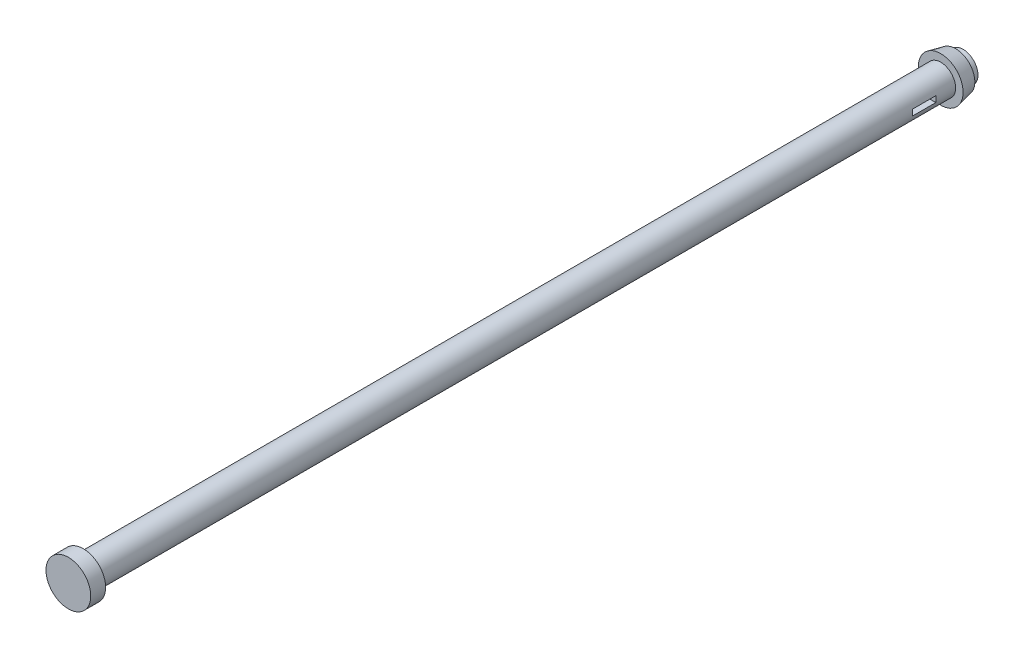
ISO-10303-21;
HEADER;
FILE_DESCRIPTION(('STEP AP214'),'2;1');
FILE_NAME('part.step','',(''),(''),'','','');
FILE_SCHEMA(('AUTOMOTIVE_DESIGN { 1 0 10303 214 1 1 1 1 }'));
ENDSEC;
DATA;
#1=APPLICATION_CONTEXT('core data for automotive mechanical design processes');
#2=APPLICATION_PROTOCOL_DEFINITION('international standard','automotive_design',2000,#1);
#3=PRODUCT_CONTEXT('',#1,'mechanical');
#4=PRODUCT('Part','Part','',(#3));
#5=PRODUCT_RELATED_PRODUCT_CATEGORY('part','',(#4));
#6=PRODUCT_DEFINITION_FORMATION('','',#4);
#7=PRODUCT_DEFINITION_CONTEXT('part definition',#1,'design');
#8=PRODUCT_DEFINITION('design','',#6,#7);
#9=PRODUCT_DEFINITION_SHAPE('','',#8);
#10=(LENGTH_UNIT() NAMED_UNIT(*) SI_UNIT(.MILLI.,.METRE.));
#11=(NAMED_UNIT(*) PLANE_ANGLE_UNIT() SI_UNIT($,.RADIAN.));
#12=(NAMED_UNIT(*) SI_UNIT($,.STERADIAN.) SOLID_ANGLE_UNIT());
#13=UNCERTAINTY_MEASURE_WITH_UNIT(LENGTH_MEASURE(1.E-05),#10,'distance_accuracy_value','');
#14=(GEOMETRIC_REPRESENTATION_CONTEXT(3) GLOBAL_UNCERTAINTY_ASSIGNED_CONTEXT((#13)) GLOBAL_UNIT_ASSIGNED_CONTEXT((#10,
#11,#12)) REPRESENTATION_CONTEXT('',''));
#15=CARTESIAN_POINT('',(0.,0.,0.));
#16=DIRECTION('',(0.,0.,1.));
#17=DIRECTION('',(1.,0.,0.));
#18=AXIS2_PLACEMENT_3D('',#15,#16,#17);
#19=CARTESIAN_POINT('',(0.,-2.05997398991745E-12,590.));
#20=DIRECTION('',(0.,0.,-1.));
#21=DIRECTION('',(0.,1.,0.));
#22=AXIS2_PLACEMENT_3D('',#19,#20,#21);
#23=CYLINDRICAL_SURFACE('',#22,10.);
#24=DIRECTION('',(0.,0.,-1.));
#25=VECTOR('',#24,1.);
#26=CARTESIAN_POINT('',(9.79795897113229,2.,590.));
#27=LINE('',#26,#25);
#28=CARTESIAN_POINT('',(9.79795897113229,2.,28.0848451641344));
#29=VERTEX_POINT('',#28);
#30=CARTESIAN_POINT('',(9.79795897113229,2.,43.8685984767884));
#31=VERTEX_POINT('',#30);
#32=EDGE_CURVE('E90',#29,#31,#27,.F.);
#33=ORIENTED_EDGE('',*,*,#32,.F.);
#34=CARTESIAN_POINT('',(0.,0.,28.0848451641345));
#35=DIRECTION('',(0.,0.,1.));
#36=DIRECTION('',(1.,0.,0.));
#37=AXIS2_PLACEMENT_3D('',#34,#35,#36);
#38=CIRCLE('',#37,10.);
#39=CARTESIAN_POINT('',(9.79795897113313,-2.,28.0848451641344));
#40=VERTEX_POINT('',#39);
#41=EDGE_CURVE('E76',#40,#29,#38,.T.);
#42=ORIENTED_EDGE('',*,*,#41,.F.);
#43=DIRECTION('',(0.,0.,-1.));
#44=VECTOR('',#43,1.);
#45=CARTESIAN_POINT('',(9.79795897113313,-2.,590.));
#46=LINE('',#45,#44);
#47=CARTESIAN_POINT('',(9.79795897113313,-1.99999999999809,43.8685984767884));
#48=VERTEX_POINT('',#47);
#49=EDGE_CURVE('E72',#40,#48,#46,.F.);
#50=ORIENTED_EDGE('',*,*,#49,.T.);
#51=CARTESIAN_POINT('',(0.,-1.53166392942909E-13,43.8685984767884));
#52=DIRECTION('',(0.,0.,-1.));
#53=DIRECTION('',(-1.,0.,0.));
#54=AXIS2_PLACEMENT_3D('',#51,#52,#53);
#55=CIRCLE('',#54,10.);
#56=EDGE_CURVE('E91',#31,#48,#55,.T.);
#57=ORIENTED_EDGE('',*,*,#56,.F.);
#58=EDGE_LOOP('',(#33,#42,#50,#57));
#59=FACE_BOUND('',#58,.T.);
#60=CARTESIAN_POINT('',(0.,-2.05997398991745E-12,590.));
#61=DIRECTION('',(0.,0.,1.));
#62=DIRECTION('',(0.,-1.,0.));
#63=AXIS2_PLACEMENT_3D('',#60,#61,#62);
#64=CIRCLE('',#63,10.);
#65=CARTESIAN_POINT('',(0.,-10.0000000000021,590.));
#66=VERTEX_POINT('',#65);
#67=EDGE_CURVE('E124',#66,#66,#64,.T.);
#68=ORIENTED_EDGE('',*,*,#67,.F.);
#69=EDGE_LOOP('',(#68));
#70=FACE_BOUND('',#69,.T.);
#71=CARTESIAN_POINT('',(0.,0.,15.));
#72=DIRECTION('',(0.,0.,-1.));
#73=DIRECTION('',(0.,1.,0.));
#74=AXIS2_PLACEMENT_3D('',#71,#72,#73);
#75=CIRCLE('',#74,10.);
#76=CARTESIAN_POINT('',(0.,9.99999999999995,15.));
#77=VERTEX_POINT('',#76);
#78=EDGE_CURVE('E77',#77,#77,#75,.T.);
#79=ORIENTED_EDGE('',*,*,#78,.F.);
#80=EDGE_LOOP('',(#79));
#81=FACE_BOUND('',#80,.T.);
#82=DIRECTION('',(0.,0.,-1.));
#83=VECTOR('',#82,1.);
#84=CARTESIAN_POINT('',(-9.79795897113229,2.,590.));
#85=LINE('',#84,#83);
#86=CARTESIAN_POINT('',(-9.79795897113229,2.,43.8685984767884));
#87=VERTEX_POINT('',#86);
#88=CARTESIAN_POINT('',(-9.79795897113229,2.,28.0848451641344));
#89=VERTEX_POINT('',#88);
#90=EDGE_CURVE('E11',#87,#89,#85,.T.);
#91=ORIENTED_EDGE('',*,*,#90,.F.);
#92=CARTESIAN_POINT('',(-9.79795897113313,-2.,43.8685984767884));
#93=VERTEX_POINT('',#92);
#94=EDGE_CURVE('E42',#93,#87,#55,.T.);
#95=ORIENTED_EDGE('',*,*,#94,.F.);
#96=DIRECTION('',(0.,0.,-1.));
#97=VECTOR('',#96,1.);
#98=CARTESIAN_POINT('',(-9.79795897113313,-2.,590.));
#99=LINE('',#98,#97);
#100=CARTESIAN_POINT('',(-9.79795897113313,-1.99999999999804,28.0848451641345));
#101=VERTEX_POINT('',#100);
#102=EDGE_CURVE('E94',#93,#101,#99,.T.);
#103=ORIENTED_EDGE('',*,*,#102,.T.);
#104=EDGE_CURVE('E83',#89,#101,#38,.T.);
#105=ORIENTED_EDGE('',*,*,#104,.F.);
#106=EDGE_LOOP('',(#91,#95,#103,#105));
#107=FACE_BOUND('',#106,.T.);
#108=ADVANCED_FACE('F34',(#59,#70,#81,#107),#23,.T.);
#109=CARTESIAN_POINT('',(0.,-2.09488880330588E-12,600.));
#110=DIRECTION('',(0.,0.,-1.));
#111=DIRECTION('',(0.,1.,0.));
#112=AXIS2_PLACEMENT_3D('',#109,#110,#111);
#113=CYLINDRICAL_SURFACE('',#112,15.);
#114=CARTESIAN_POINT('',(0.,-2.09488880330588E-12,600.));
#115=DIRECTION('',(0.,0.,1.));
#116=DIRECTION('',(0.,-1.,0.));
#117=AXIS2_PLACEMENT_3D('',#114,#115,#116);
#118=CIRCLE('',#117,15.);
#119=CARTESIAN_POINT('',(0.,-15.0000000000021,600.));
#120=VERTEX_POINT('',#119);
#121=EDGE_CURVE('E117',#120,#120,#118,.T.);
#122=ORIENTED_EDGE('',*,*,#121,.F.);
#123=EDGE_LOOP('',(#122));
#124=FACE_BOUND('',#123,.T.);
#125=CARTESIAN_POINT('',(0.,-2.05997398991745E-12,590.));
#126=DIRECTION('',(0.,0.,1.));
#127=DIRECTION('',(0.,-1.,0.));
#128=AXIS2_PLACEMENT_3D('',#125,#126,#127);
#129=CIRCLE('',#128,15.);
#130=CARTESIAN_POINT('',(0.,-15.0000000000021,590.));
#131=VERTEX_POINT('',#130);
#132=EDGE_CURVE('E121',#131,#131,#129,.T.);
#133=ORIENTED_EDGE('',*,*,#132,.T.);
#134=EDGE_LOOP('',(#133));
#135=FACE_BOUND('',#134,.T.);
#136=ADVANCED_FACE('F160',(#124,#135),#113,.T.);
#137=CARTESIAN_POINT('',(0.,-2.09488880330588E-12,600.));
#138=DIRECTION('',(0.,0.,1.));
#139=DIRECTION('',(0.,-1.,0.));
#140=AXIS2_PLACEMENT_3D('',#137,#138,#139);
#141=PLANE('',#140);
#142=ORIENTED_EDGE('',*,*,#121,.T.);
#143=EDGE_LOOP('',(#142));
#144=FACE_BOUND('',#143,.T.);
#145=ADVANCED_FACE('F165',(#144),#141,.T.);
#146=CARTESIAN_POINT('',(0.,-2.05997398991745E-12,590.));
#147=DIRECTION('',(0.,0.,1.));
#148=DIRECTION('',(0.,-1.,0.));
#149=AXIS2_PLACEMENT_3D('',#146,#147,#148);
#150=PLANE('',#149);
#151=ORIENTED_EDGE('',*,*,#67,.T.);
#152=EDGE_LOOP('',(#151));
#153=FACE_BOUND('',#152,.T.);
#154=ORIENTED_EDGE('',*,*,#132,.F.);
#155=EDGE_LOOP('',(#154));
#156=FACE_BOUND('',#155,.T.);
#157=ADVANCED_FACE('F146',(#153,#156),#150,.F.);
#158=CARTESIAN_POINT('',(0.,0.,15.));
#159=DIRECTION('',(0.,0.,1.));
#160=DIRECTION('',(0.,1.,0.));
#161=AXIS2_PLACEMENT_3D('',#158,#159,#160);
#162=CONICAL_SURFACE('',#161,15.,0.20943951023932);
#163=CARTESIAN_POINT('',(0.,0.,5.));
#164=DIRECTION('',(0.,0.,-1.));
#165=DIRECTION('',(0.,1.,0.));
#166=AXIS2_PLACEMENT_3D('',#163,#164,#165);
#167=CIRCLE('',#166,12.8744343832998);
#168=CARTESIAN_POINT('',(0.,12.8744343832998,5.00000000000004));
#169=VERTEX_POINT('',#168);
#170=EDGE_CURVE('E113',#169,#169,#167,.T.);
#171=ORIENTED_EDGE('',*,*,#170,.F.);
#172=EDGE_LOOP('',(#171));
#173=FACE_BOUND('',#172,.T.);
#174=CARTESIAN_POINT('',(0.,0.,15.));
#175=DIRECTION('',(0.,0.,-1.));
#176=DIRECTION('',(0.,1.,0.));
#177=AXIS2_PLACEMENT_3D('',#174,#175,#176);
#178=CIRCLE('',#177,15.);
#179=CARTESIAN_POINT('',(0.,14.9999999999999,15.0000000000001));
#180=VERTEX_POINT('',#179);
#181=EDGE_CURVE('E107',#180,#180,#178,.T.);
#182=ORIENTED_EDGE('',*,*,#181,.T.);
#183=EDGE_LOOP('',(#182));
#184=FACE_BOUND('',#183,.T.);
#185=ADVANCED_FACE('F140',(#173,#184),#162,.T.);
#186=CARTESIAN_POINT('',(0.,0.,5.));
#187=DIRECTION('',(0.,0.,-1.));
#188=DIRECTION('',(0.,1.,0.));
#189=AXIS2_PLACEMENT_3D('',#186,#187,#188);
#190=PLANE('',#189);
#191=CARTESIAN_POINT('',(0.,0.,5.));
#192=DIRECTION('',(0.,0.,-1.));
#193=DIRECTION('',(0.,1.,0.));
#194=AXIS2_PLACEMENT_3D('',#191,#192,#193);
#195=CIRCLE('',#194,10.);
#196=CARTESIAN_POINT('',(0.,9.99999999999998,5.00000000000004));
#197=VERTEX_POINT('',#196);
#198=EDGE_CURVE('E116',#197,#197,#195,.T.);
#199=ORIENTED_EDGE('',*,*,#198,.F.);
#200=EDGE_LOOP('',(#199));
#201=FACE_BOUND('',#200,.T.);
#202=ORIENTED_EDGE('',*,*,#170,.T.);
#203=EDGE_LOOP('',(#202));
#204=FACE_BOUND('',#203,.T.);
#205=ADVANCED_FACE('F136',(#201,#204),#190,.T.);
#206=CARTESIAN_POINT('',(0.,0.,15.));
#207=DIRECTION('',(0.,0.,-1.));
#208=DIRECTION('',(0.,1.,0.));
#209=AXIS2_PLACEMENT_3D('',#206,#207,#208);
#210=PLANE('',#209);
#211=ORIENTED_EDGE('',*,*,#78,.T.);
#212=EDGE_LOOP('',(#211));
#213=FACE_BOUND('',#212,.T.);
#214=ORIENTED_EDGE('',*,*,#181,.F.);
#215=EDGE_LOOP('',(#214));
#216=FACE_BOUND('',#215,.T.);
#217=ADVANCED_FACE('F139',(#213,#216),#210,.F.);
#218=CARTESIAN_POINT('',(0.,0.,0.));
#219=DIRECTION('',(0.,0.,1.));
#220=DIRECTION('',(0.,-1.,0.));
#221=AXIS2_PLACEMENT_3D('',#218,#219,#220);
#222=PLANE('',#221);
#223=CARTESIAN_POINT('',(0.,0.,0.));
#224=DIRECTION('',(0.,0.,1.));
#225=DIRECTION('',(0.,-1.,0.));
#226=AXIS2_PLACEMENT_3D('',#223,#224,#225);
#227=CIRCLE('',#226,10.);
#228=CARTESIAN_POINT('',(0.,-10.,0.));
#229=VERTEX_POINT('',#228);
#230=EDGE_CURVE('E120',#229,#229,#227,.T.);
#231=ORIENTED_EDGE('',*,*,#230,.F.);
#232=EDGE_LOOP('',(#231));
#233=FACE_BOUND('',#232,.T.);
#234=ADVANCED_FACE('F151',(#233),#222,.F.);
#235=ORIENTED_EDGE('',*,*,#198,.T.);
#236=EDGE_LOOP('',(#235));
#237=FACE_BOUND('',#236,.T.);
#238=ORIENTED_EDGE('',*,*,#230,.T.);
#239=EDGE_LOOP('',(#238));
#240=FACE_BOUND('',#239,.T.);
#241=ADVANCED_FACE('F36',(#237,#240),#23,.T.);
#242=CARTESIAN_POINT('',(10.,2.,43.8685984767884));
#243=DIRECTION('',(0.,0.,-1.));
#244=DIRECTION('',(-1.,0.,0.));
#245=AXIS2_PLACEMENT_3D('',#242,#243,#244);
#246=PLANE('',#245);
#247=DIRECTION('',(1.,0.,0.));
#248=VECTOR('',#247,1.);
#249=CARTESIAN_POINT('',(10.,2.,43.8685984767884));
#250=LINE('',#249,#248);
#251=EDGE_CURVE('E85',#87,#31,#250,.T.);
#252=ORIENTED_EDGE('',*,*,#251,.T.);
#253=ORIENTED_EDGE('',*,*,#56,.T.);
#254=DIRECTION('',(1.,0.,0.));
#255=VECTOR('',#254,1.);
#256=CARTESIAN_POINT('',(10.,-2.,43.8685984767884));
#257=LINE('',#256,#255);
#258=EDGE_CURVE('E54',#93,#48,#257,.T.);
#259=ORIENTED_EDGE('',*,*,#258,.F.);
#260=ORIENTED_EDGE('',*,*,#94,.T.);
#261=EDGE_LOOP('',(#252,#253,#259,#260));
#262=FACE_BOUND('',#261,.T.);
#263=ADVANCED_FACE('F105',(#262),#246,.T.);
#264=CARTESIAN_POINT('',(-10.,2.,28.0848451641344));
#265=DIRECTION('',(0.,0.,1.));
#266=DIRECTION('',(1.,0.,0.));
#267=AXIS2_PLACEMENT_3D('',#264,#265,#266);
#268=PLANE('',#267);
#269=DIRECTION('',(-1.,0.,0.));
#270=VECTOR('',#269,1.);
#271=CARTESIAN_POINT('',(-10.,2.,28.0848451641344));
#272=LINE('',#271,#270);
#273=EDGE_CURVE('E103',#29,#89,#272,.T.);
#274=ORIENTED_EDGE('',*,*,#273,.T.);
#275=ORIENTED_EDGE('',*,*,#104,.T.);
#276=DIRECTION('',(-1.,0.,0.));
#277=VECTOR('',#276,1.);
#278=CARTESIAN_POINT('',(-10.,-2.,28.0848451641344));
#279=LINE('',#278,#277);
#280=EDGE_CURVE('E49',#40,#101,#279,.T.);
#281=ORIENTED_EDGE('',*,*,#280,.F.);
#282=ORIENTED_EDGE('',*,*,#41,.T.);
#283=EDGE_LOOP('',(#274,#275,#281,#282));
#284=FACE_BOUND('',#283,.T.);
#285=ADVANCED_FACE('F81',(#284),#268,.T.);
#286=CARTESIAN_POINT('',(0.,2.,0.));
#287=DIRECTION('',(0.,-1.,0.));
#288=DIRECTION('',(0.,0.,-1.));
#289=AXIS2_PLACEMENT_3D('',#286,#287,#288);
#290=PLANE('',#289);
#291=ORIENTED_EDGE('',*,*,#90,.T.);
#292=ORIENTED_EDGE('',*,*,#273,.F.);
#293=ORIENTED_EDGE('',*,*,#32,.T.);
#294=ORIENTED_EDGE('',*,*,#251,.F.);
#295=EDGE_LOOP('',(#291,#292,#293,#294));
#296=FACE_BOUND('',#295,.T.);
#297=ADVANCED_FACE('F101',(#296),#290,.T.);
#298=CARTESIAN_POINT('',(0.,-2.,0.));
#299=DIRECTION('',(0.,-1.,0.));
#300=DIRECTION('',(0.,0.,-1.));
#301=AXIS2_PLACEMENT_3D('',#298,#299,#300);
#302=PLANE('',#301);
#303=ORIENTED_EDGE('',*,*,#258,.T.);
#304=ORIENTED_EDGE('',*,*,#49,.F.);
#305=ORIENTED_EDGE('',*,*,#280,.T.);
#306=ORIENTED_EDGE('',*,*,#102,.F.);
#307=EDGE_LOOP('',(#303,#304,#305,#306));
#308=FACE_BOUND('',#307,.T.);
#309=ADVANCED_FACE('F73',(#308),#302,.F.);
#310=CLOSED_SHELL('',(#108,#136,#145,#157,#185,#205,#217,#234,#241,#263,#285,#297,#309));
#311=MANIFOLD_SOLID_BREP('B2',#310);
#312=ADVANCED_BREP_SHAPE_REPRESENTATION('',(#18,#311),#14);
#313=SHAPE_DEFINITION_REPRESENTATION(#9,#312);
ENDSEC;
END-ISO-10303-21;
